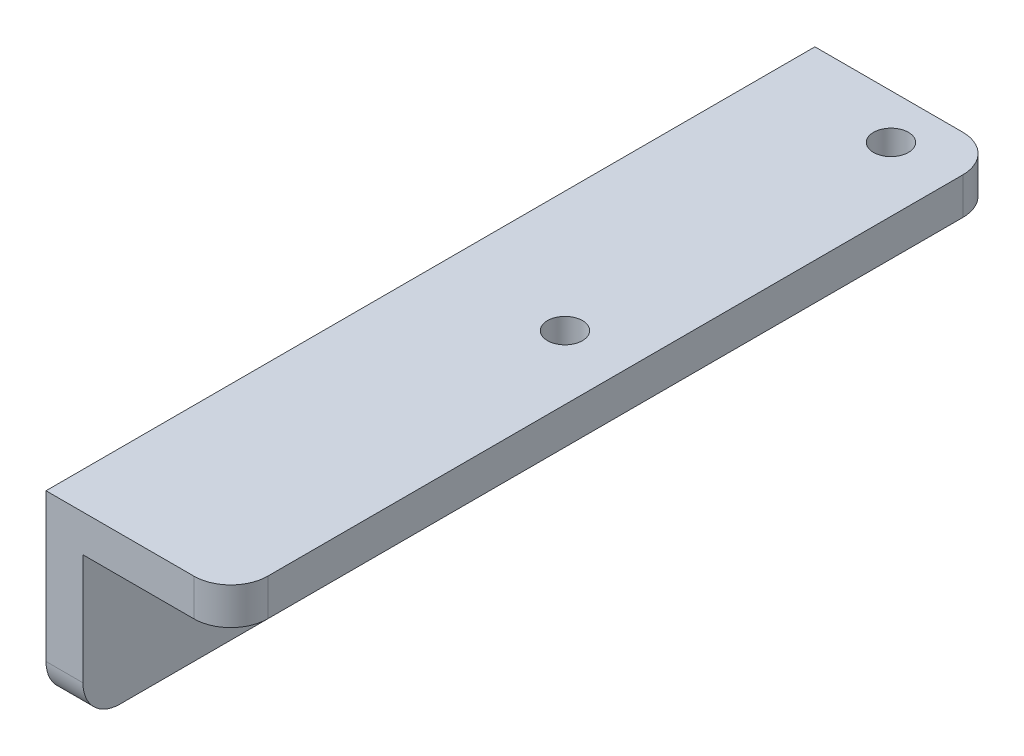
ISO-10303-21;
HEADER;
FILE_DESCRIPTION(('STEP AP214'),'2;1');
FILE_NAME('part.step','',(''),(''),'','','');
FILE_SCHEMA(('AUTOMOTIVE_DESIGN { 1 0 10303 214 1 1 1 1 }'));
ENDSEC;
DATA;
#1=APPLICATION_CONTEXT('core data for automotive mechanical design processes');
#2=APPLICATION_PROTOCOL_DEFINITION('international standard','automotive_design',2000,#1);
#3=PRODUCT_CONTEXT('',#1,'mechanical');
#4=PRODUCT('Part','Part','',(#3));
#5=PRODUCT_RELATED_PRODUCT_CATEGORY('part','',(#4));
#6=PRODUCT_DEFINITION_FORMATION('','',#4);
#7=PRODUCT_DEFINITION_CONTEXT('part definition',#1,'design');
#8=PRODUCT_DEFINITION('design','',#6,#7);
#9=PRODUCT_DEFINITION_SHAPE('','',#8);
#10=(LENGTH_UNIT() NAMED_UNIT(*) SI_UNIT(.MILLI.,.METRE.));
#11=(NAMED_UNIT(*) PLANE_ANGLE_UNIT() SI_UNIT($,.RADIAN.));
#12=(NAMED_UNIT(*) SI_UNIT($,.STERADIAN.) SOLID_ANGLE_UNIT());
#13=UNCERTAINTY_MEASURE_WITH_UNIT(LENGTH_MEASURE(1.E-05),#10,'distance_accuracy_value','');
#14=(GEOMETRIC_REPRESENTATION_CONTEXT(3) GLOBAL_UNCERTAINTY_ASSIGNED_CONTEXT((#13)) GLOBAL_UNIT_ASSIGNED_CONTEXT((#10,
#11,#12)) REPRESENTATION_CONTEXT('',''));
#15=CARTESIAN_POINT('',(0.,0.,0.));
#16=DIRECTION('',(0.,0.,1.));
#17=DIRECTION('',(1.,0.,0.));
#18=AXIS2_PLACEMENT_3D('',#15,#16,#17);
#19=CARTESIAN_POINT('',(0.,-15.875,-66.04));
#20=DIRECTION('',(0.,-1.,0.));
#21=DIRECTION('',(0.,0.,-1.));
#22=AXIS2_PLACEMENT_3D('',#19,#20,#21);
#23=PLANE('',#22);
#24=DIRECTION('',(0.,0.,1.));
#25=VECTOR('',#24,1.);
#26=CARTESIAN_POINT('',(3.175,-15.875,-66.04));
#27=LINE('',#26,#25);
#28=CARTESIAN_POINT('',(3.175,-15.875,-17.145));
#29=VERTEX_POINT('',#28);
#30=CARTESIAN_POINT('',(3.175,-15.875,-3.175));
#31=VERTEX_POINT('',#30);
#32=EDGE_CURVE('E251',#29,#31,#27,.T.);
#33=ORIENTED_EDGE('',*,*,#32,.T.);
#34=DIRECTION('',(1.,0.,0.));
#35=VECTOR('',#34,1.);
#36=CARTESIAN_POINT('',(0.,-15.875,-3.175));
#37=LINE('',#36,#35);
#38=CARTESIAN_POINT('',(0.,-15.875,-3.175));
#39=VERTEX_POINT('',#38);
#40=EDGE_CURVE('E287',#31,#39,#37,.F.);
#41=ORIENTED_EDGE('',*,*,#40,.T.);
#42=DIRECTION('',(0.,0.,1.));
#43=VECTOR('',#42,1.);
#44=CARTESIAN_POINT('',(0.,-15.875,-66.04));
#45=LINE('',#44,#43);
#46=CARTESIAN_POINT('',(0.,-15.875,-37.465));
#47=VERTEX_POINT('',#46);
#48=EDGE_CURVE('E252',#47,#39,#45,.T.);
#49=ORIENTED_EDGE('',*,*,#48,.F.);
#50=DIRECTION('',(-1.,0.,0.));
#51=VECTOR('',#50,1.);
#52=CARTESIAN_POINT('',(0.,-15.875,-37.465));
#53=LINE('',#52,#51);
#54=CARTESIAN_POINT('',(3.175,-15.875,-37.465));
#55=VERTEX_POINT('',#54);
#56=EDGE_CURVE('E285',#47,#55,#53,.F.);
#57=ORIENTED_EDGE('',*,*,#56,.T.);
#58=CARTESIAN_POINT('',(3.175,-15.875,-22.225));
#59=VERTEX_POINT('',#58);
#60=EDGE_CURVE('E249',#55,#59,#27,.T.);
#61=ORIENTED_EDGE('',*,*,#60,.T.);
#62=DIRECTION('',(0.,0.,-1.));
#63=VECTOR('',#62,1.);
#64=CARTESIAN_POINT('',(3.175,-15.875,-17.145));
#65=LINE('',#64,#63);
#66=EDGE_CURVE('E198',#29,#59,#65,.T.);
#67=ORIENTED_EDGE('',*,*,#66,.F.);
#68=EDGE_LOOP('',(#33,#41,#49,#57,#61,#67));
#69=FACE_BOUND('',#68,.T.);
#70=ADVANCED_FACE('F45',(#69),#23,.T.);
#71=CARTESIAN_POINT('',(0.,-3.175,-66.04));
#72=DIRECTION('',(0.,-1.,0.));
#73=DIRECTION('',(0.,0.,-1.));
#74=AXIS2_PLACEMENT_3D('',#71,#72,#73);
#75=PLANE('',#74);
#76=DIRECTION('',(0.,0.,1.));
#77=VECTOR('',#76,1.);
#78=CARTESIAN_POINT('',(15.875,-3.175,-66.04));
#79=LINE('',#78,#77);
#80=CARTESIAN_POINT('',(15.875,-3.175,-17.145));
#81=VERTEX_POINT('',#80);
#82=CARTESIAN_POINT('',(15.875,-3.175,-3.175));
#83=VERTEX_POINT('',#82);
#84=EDGE_CURVE('E234',#81,#83,#79,.T.);
#85=ORIENTED_EDGE('',*,*,#84,.T.);
#86=CARTESIAN_POINT('',(12.7,-3.175,-3.175));
#87=DIRECTION('',(0.,-1.,0.));
#88=DIRECTION('',(0.,0.,-1.));
#89=AXIS2_PLACEMENT_3D('',#86,#87,#88);
#90=CIRCLE('',#89,3.175);
#91=CARTESIAN_POINT('',(12.7,-3.175,0.));
#92=VERTEX_POINT('',#91);
#93=EDGE_CURVE('E281',#83,#92,#90,.T.);
#94=ORIENTED_EDGE('',*,*,#93,.T.);
#95=DIRECTION('',(1.,0.,0.));
#96=VECTOR('',#95,1.);
#97=CARTESIAN_POINT('',(0.,-3.175,0.));
#98=LINE('',#97,#96);
#99=CARTESIAN_POINT('',(3.175,-3.175,0.));
#100=VERTEX_POINT('',#99);
#101=EDGE_CURVE('E214',#100,#92,#98,.T.);
#102=ORIENTED_EDGE('',*,*,#101,.F.);
#103=DIRECTION('',(0.,0.,1.));
#104=VECTOR('',#103,1.);
#105=CARTESIAN_POINT('',(3.175,-3.175,-66.04));
#106=LINE('',#105,#104);
#107=CARTESIAN_POINT('',(3.175,-3.175,-17.145));
#108=VERTEX_POINT('',#107);
#109=EDGE_CURVE('E248',#108,#100,#106,.T.);
#110=ORIENTED_EDGE('',*,*,#109,.F.);
#111=DIRECTION('',(-1.,0.,0.));
#112=VECTOR('',#111,1.);
#113=CARTESIAN_POINT('',(3.175,-3.175,-17.145));
#114=LINE('',#113,#112);
#115=EDGE_CURVE('E191',#81,#108,#114,.T.);
#116=ORIENTED_EDGE('',*,*,#115,.F.);
#117=EDGE_LOOP('',(#85,#94,#102,#110,#116));
#118=FACE_BOUND('',#117,.T.);
#119=ADVANCED_FACE('F322',(#118),#75,.T.);
#120=CARTESIAN_POINT('',(3.175,0.,-66.04));
#121=DIRECTION('',(1.,0.,0.));
#122=DIRECTION('',(0.,0.,-1.));
#123=AXIS2_PLACEMENT_3D('',#120,#121,#122);
#124=PLANE('',#123);
#125=CARTESIAN_POINT('',(3.175,-9.525,-9.94999999999847));
#126=DIRECTION('',(1.,0.,0.));
#127=DIRECTION('',(0.,0.,-1.));
#128=AXIS2_PLACEMENT_3D('',#125,#126,#127);
#129=CIRCLE('',#128,2.49999999987849);
#130=CARTESIAN_POINT('',(3.175,-9.525,-12.449999999877));
#131=VERTEX_POINT('',#130);
#132=EDGE_CURVE('E218',#131,#131,#129,.T.);
#133=ORIENTED_EDGE('',*,*,#132,.F.);
#134=EDGE_LOOP('',(#133));
#135=FACE_BOUND('',#134,.T.);
#136=DIRECTION('',(0.,1.,0.));
#137=VECTOR('',#136,1.);
#138=CARTESIAN_POINT('',(3.175,0.,0.));
#139=LINE('',#138,#137);
#140=CARTESIAN_POINT('',(3.175,-12.7,0.));
#141=VERTEX_POINT('',#140);
#142=EDGE_CURVE('E227',#141,#100,#139,.T.);
#143=ORIENTED_EDGE('',*,*,#142,.F.);
#144=CARTESIAN_POINT('',(3.175,-12.7,-3.175));
#145=DIRECTION('',(1.,0.,0.));
#146=DIRECTION('',(0.,0.,-1.));
#147=AXIS2_PLACEMENT_3D('',#144,#145,#146);
#148=CIRCLE('',#147,3.175);
#149=EDGE_CURVE('E283',#141,#31,#148,.T.);
#150=ORIENTED_EDGE('',*,*,#149,.T.);
#151=ORIENTED_EDGE('',*,*,#32,.F.);
#152=DIRECTION('',(0.,-1.,0.));
#153=VECTOR('',#152,1.);
#154=CARTESIAN_POINT('',(3.175,-15.875,-17.145));
#155=LINE('',#154,#153);
#156=EDGE_CURVE('E195',#108,#29,#155,.T.);
#157=ORIENTED_EDGE('',*,*,#156,.F.);
#158=ORIENTED_EDGE('',*,*,#109,.T.);
#159=EDGE_LOOP('',(#143,#150,#151,#157,#158));
#160=FACE_BOUND('',#159,.T.);
#161=ADVANCED_FACE('F329',(#135,#160),#124,.T.);
#162=CARTESIAN_POINT('',(10.375,-3.175,-34.1966885776124));
#163=DIRECTION('',(0.,-1.,0.));
#164=DIRECTION('',(0.,0.,-1.));
#165=AXIS2_PLACEMENT_3D('',#162,#163,#164);
#166=CIRCLE('',#165,1.5);
#167=CARTESIAN_POINT('',(10.375,-3.175,-35.6966885776124));
#168=VERTEX_POINT('',#167);
#169=EDGE_CURVE('E264',#168,#168,#166,.T.);
#170=ORIENTED_EDGE('',*,*,#169,.F.);
#171=EDGE_LOOP('',(#170));
#172=FACE_BOUND('',#171,.T.);
#173=CARTESIAN_POINT('',(10.375,-3.175,-62.1966885776124));
#174=DIRECTION('',(0.,-1.,0.));
#175=DIRECTION('',(0.,0.,-1.));
#176=AXIS2_PLACEMENT_3D('',#173,#174,#175);
#177=CIRCLE('',#176,1.5);
#178=CARTESIAN_POINT('',(10.375,-3.175,-63.6966885776124));
#179=VERTEX_POINT('',#178);
#180=EDGE_CURVE('E574',#179,#179,#177,.T.);
#181=ORIENTED_EDGE('',*,*,#180,.F.);
#182=EDGE_LOOP('',(#181));
#183=FACE_BOUND('',#182,.T.);
#184=DIRECTION('',(1.,0.,0.));
#185=VECTOR('',#184,1.);
#186=CARTESIAN_POINT('',(0.,-3.175,-66.04));
#187=LINE('',#186,#185);
#188=CARTESIAN_POINT('',(3.175,-3.175,-66.04));
#189=VERTEX_POINT('',#188);
#190=CARTESIAN_POINT('',(12.7,-3.175,-66.04));
#191=VERTEX_POINT('',#190);
#192=EDGE_CURVE('E223',#189,#191,#187,.T.);
#193=ORIENTED_EDGE('',*,*,#192,.T.);
#194=CARTESIAN_POINT('',(12.7,-3.175,-62.865));
#195=DIRECTION('',(0.,-1.,0.));
#196=DIRECTION('',(0.,0.,-1.));
#197=AXIS2_PLACEMENT_3D('',#194,#195,#196);
#198=CIRCLE('',#197,3.175);
#199=CARTESIAN_POINT('',(15.875,-3.175,-62.865));
#200=VERTEX_POINT('',#199);
#201=EDGE_CURVE('E298',#191,#200,#198,.T.);
#202=ORIENTED_EDGE('',*,*,#201,.T.);
#203=CARTESIAN_POINT('',(15.875,-3.175,-22.225));
#204=VERTEX_POINT('',#203);
#205=EDGE_CURVE('E259',#200,#204,#79,.T.);
#206=ORIENTED_EDGE('',*,*,#205,.T.);
#207=DIRECTION('',(-1.,0.,0.));
#208=VECTOR('',#207,1.);
#209=CARTESIAN_POINT('',(3.175,-3.175,-22.225));
#210=LINE('',#209,#208);
#211=CARTESIAN_POINT('',(3.175,-3.175,-22.225));
#212=VERTEX_POINT('',#211);
#213=EDGE_CURVE('E201',#204,#212,#210,.T.);
#214=ORIENTED_EDGE('',*,*,#213,.T.);
#215=EDGE_CURVE('E244',#189,#212,#106,.T.);
#216=ORIENTED_EDGE('',*,*,#215,.F.);
#217=EDGE_LOOP('',(#193,#202,#206,#214,#216));
#218=FACE_BOUND('',#217,.T.);
#219=ADVANCED_FACE('F332',(#172,#183,#218),#75,.T.);
#220=DIRECTION('',(0.,0.,-1.));
#221=VECTOR('',#220,1.);
#222=CARTESIAN_POINT('',(3.175,-8.255,-40.64));
#223=LINE('',#222,#221);
#224=CARTESIAN_POINT('',(3.175,-8.255,-40.64));
#225=VERTEX_POINT('',#224);
#226=CARTESIAN_POINT('',(3.175,-8.255,-62.865));
#227=VERTEX_POINT('',#226);
#228=EDGE_CURVE('E174',#225,#227,#223,.T.);
#229=ORIENTED_EDGE('',*,*,#228,.T.);
#230=CARTESIAN_POINT('',(3.175,-5.08,-62.865));
#231=DIRECTION('',(1.,0.,0.));
#232=DIRECTION('',(0.,0.,-1.));
#233=AXIS2_PLACEMENT_3D('',#230,#231,#232);
#234=CIRCLE('',#233,3.175);
#235=CARTESIAN_POINT('',(3.175,-5.08,-66.04));
#236=VERTEX_POINT('',#235);
#237=EDGE_CURVE('E53',#227,#236,#234,.T.);
#238=ORIENTED_EDGE('',*,*,#237,.T.);
#239=DIRECTION('',(0.,1.,0.));
#240=VECTOR('',#239,1.);
#241=CARTESIAN_POINT('',(3.175,0.,-66.04));
#242=LINE('',#241,#240);
#243=EDGE_CURVE('E232',#236,#189,#242,.T.);
#244=ORIENTED_EDGE('',*,*,#243,.T.);
#245=ORIENTED_EDGE('',*,*,#215,.T.);
#246=DIRECTION('',(0.,-1.,0.));
#247=VECTOR('',#246,1.);
#248=CARTESIAN_POINT('',(3.175,-15.875,-22.225));
#249=LINE('',#248,#247);
#250=EDGE_CURVE('E192',#212,#59,#249,.T.);
#251=ORIENTED_EDGE('',*,*,#250,.T.);
#252=ORIENTED_EDGE('',*,*,#60,.F.);
#253=CARTESIAN_POINT('',(3.175,-12.7,-37.465));
#254=DIRECTION('',(1.,0.,0.));
#255=DIRECTION('',(0.,0.,-1.));
#256=AXIS2_PLACEMENT_3D('',#253,#254,#255);
#257=CIRCLE('',#256,3.175);
#258=CARTESIAN_POINT('',(3.175,-12.7,-40.64));
#259=VERTEX_POINT('',#258);
#260=EDGE_CURVE('E60',#55,#259,#257,.T.);
#261=ORIENTED_EDGE('',*,*,#260,.T.);
#262=DIRECTION('',(0.,-1.,0.));
#263=VECTOR('',#262,1.);
#264=CARTESIAN_POINT('',(3.175,-15.875,-40.64));
#265=LINE('',#264,#263);
#266=EDGE_CURVE('E175',#225,#259,#265,.T.);
#267=ORIENTED_EDGE('',*,*,#266,.F.);
#268=EDGE_LOOP('',(#229,#238,#244,#245,#251,#252,#261,#267));
#269=FACE_BOUND('',#268,.T.);
#270=CARTESIAN_POINT('',(3.175,-9.52499999999992,-29.9499999999985));
#271=DIRECTION('',(1.,0.,0.));
#272=DIRECTION('',(0.,0.,-1.));
#273=AXIS2_PLACEMENT_3D('',#270,#271,#272);
#274=CIRCLE('',#273,2.49999999987849);
#275=CARTESIAN_POINT('',(3.175,-9.52499999999992,-32.449999999877));
#276=VERTEX_POINT('',#275);
#277=EDGE_CURVE('E215',#276,#276,#274,.T.);
#278=ORIENTED_EDGE('',*,*,#277,.F.);
#279=EDGE_LOOP('',(#278));
#280=FACE_BOUND('',#279,.T.);
#281=ADVANCED_FACE('F303',(#269,#280),#124,.T.);
#282=CARTESIAN_POINT('',(0.,0.,-66.04));
#283=DIRECTION('',(-1.,0.,0.));
#284=DIRECTION('',(0.,-1.,0.));
#285=AXIS2_PLACEMENT_3D('',#282,#283,#284);
#286=PLANE('',#285);
#287=ORIENTED_EDGE('',*,*,#48,.T.);
#288=CARTESIAN_POINT('',(0.,-12.7,-3.175));
#289=DIRECTION('',(-1.,0.,0.));
#290=DIRECTION('',(0.,-1.,0.));
#291=AXIS2_PLACEMENT_3D('',#288,#289,#290);
#292=CIRCLE('',#291,3.175);
#293=CARTESIAN_POINT('',(0.,-12.7,0.));
#294=VERTEX_POINT('',#293);
#295=EDGE_CURVE('E292',#39,#294,#292,.T.);
#296=ORIENTED_EDGE('',*,*,#295,.T.);
#297=DIRECTION('',(0.,-1.,0.));
#298=VECTOR('',#297,1.);
#299=CARTESIAN_POINT('',(0.,0.,0.));
#300=LINE('',#299,#298);
#301=CARTESIAN_POINT('',(0.,0.,0.));
#302=VERTEX_POINT('',#301);
#303=EDGE_CURVE('E240',#302,#294,#300,.T.);
#304=ORIENTED_EDGE('',*,*,#303,.F.);
#305=DIRECTION('',(0.,0.,1.));
#306=VECTOR('',#305,1.);
#307=CARTESIAN_POINT('',(0.,0.,-66.04));
#308=LINE('',#307,#306);
#309=CARTESIAN_POINT('',(0.,0.,-66.04));
#310=VERTEX_POINT('',#309);
#311=EDGE_CURVE('E254',#310,#302,#308,.T.);
#312=ORIENTED_EDGE('',*,*,#311,.F.);
#313=DIRECTION('',(0.,-1.,0.));
#314=VECTOR('',#313,1.);
#315=CARTESIAN_POINT('',(0.,0.,-66.04));
#316=LINE('',#315,#314);
#317=CARTESIAN_POINT('',(0.,-5.08,-66.04));
#318=VERTEX_POINT('',#317);
#319=EDGE_CURVE('E230',#310,#318,#316,.T.);
#320=ORIENTED_EDGE('',*,*,#319,.T.);
#321=CARTESIAN_POINT('',(0.,-5.08,-62.865));
#322=DIRECTION('',(-1.,0.,0.));
#323=DIRECTION('',(0.,-1.,0.));
#324=AXIS2_PLACEMENT_3D('',#321,#322,#323);
#325=CIRCLE('',#324,3.175);
#326=CARTESIAN_POINT('',(0.,-8.255,-62.865));
#327=VERTEX_POINT('',#326);
#328=EDGE_CURVE('E182',#318,#327,#325,.T.);
#329=ORIENTED_EDGE('',*,*,#328,.T.);
#330=DIRECTION('',(0.,0.,-1.));
#331=VECTOR('',#330,1.);
#332=CARTESIAN_POINT('',(0.,-8.255,-40.64));
#333=LINE('',#332,#331);
#334=CARTESIAN_POINT('',(0.,-8.255,-40.64));
#335=VERTEX_POINT('',#334);
#336=EDGE_CURVE('E172',#335,#327,#333,.T.);
#337=ORIENTED_EDGE('',*,*,#336,.F.);
#338=DIRECTION('',(0.,1.,0.));
#339=VECTOR('',#338,1.);
#340=CARTESIAN_POINT('',(0.,-15.875,-40.64));
#341=LINE('',#340,#339);
#342=CARTESIAN_POINT('',(0.,-12.7,-40.64));
#343=VERTEX_POINT('',#342);
#344=EDGE_CURVE('E160',#343,#335,#341,.T.);
#345=ORIENTED_EDGE('',*,*,#344,.F.);
#346=CARTESIAN_POINT('',(0.,-12.7,-37.465));
#347=DIRECTION('',(-1.,0.,0.));
#348=DIRECTION('',(0.,-1.,0.));
#349=AXIS2_PLACEMENT_3D('',#346,#347,#348);
#350=CIRCLE('',#349,3.175);
#351=EDGE_CURVE('E289',#343,#47,#350,.T.);
#352=ORIENTED_EDGE('',*,*,#351,.T.);
#353=EDGE_LOOP('',(#287,#296,#304,#312,#320,#329,#337,#345,#352));
#354=FACE_BOUND('',#353,.T.);
#355=CARTESIAN_POINT('',(0.,-9.52499999999992,-29.9499999999985));
#356=DIRECTION('',(1.,0.,0.));
#357=DIRECTION('',(0.,0.,-1.));
#358=AXIS2_PLACEMENT_3D('',#355,#356,#357);
#359=CIRCLE('',#358,2.49999999987849);
#360=CARTESIAN_POINT('',(0.,-9.52499999999992,-32.449999999877));
#361=VERTEX_POINT('',#360);
#362=EDGE_CURVE('E211',#361,#361,#359,.T.);
#363=ORIENTED_EDGE('',*,*,#362,.T.);
#364=EDGE_LOOP('',(#363));
#365=FACE_BOUND('',#364,.T.);
#366=CARTESIAN_POINT('',(0.,-9.525,-9.94999999999847));
#367=DIRECTION('',(1.,0.,0.));
#368=DIRECTION('',(0.,0.,-1.));
#369=AXIS2_PLACEMENT_3D('',#366,#367,#368);
#370=CIRCLE('',#369,2.49999999987849);
#371=CARTESIAN_POINT('',(0.,-9.525,-12.449999999877));
#372=VERTEX_POINT('',#371);
#373=EDGE_CURVE('E210',#372,#372,#370,.T.);
#374=ORIENTED_EDGE('',*,*,#373,.T.);
#375=EDGE_LOOP('',(#374));
#376=FACE_BOUND('',#375,.T.);
#377=ADVANCED_FACE('F178',(#354,#365,#376),#286,.T.);
#378=CARTESIAN_POINT('',(0.,0.,-66.04));
#379=DIRECTION('',(0.,-1.,0.));
#380=DIRECTION('',(0.,0.,-1.));
#381=AXIS2_PLACEMENT_3D('',#378,#379,#380);
#382=PLANE('',#381);
#383=CARTESIAN_POINT('',(10.375,0.,-34.1966885776124));
#384=DIRECTION('',(0.,-1.,0.));
#385=DIRECTION('',(0.,0.,-1.));
#386=AXIS2_PLACEMENT_3D('',#383,#384,#385);
#387=CIRCLE('',#386,1.5);
#388=CARTESIAN_POINT('',(10.375,0.,-35.6966885776124));
#389=VERTEX_POINT('',#388);
#390=EDGE_CURVE('E167',#389,#389,#387,.T.);
#391=ORIENTED_EDGE('',*,*,#390,.T.);
#392=EDGE_LOOP('',(#391));
#393=FACE_BOUND('',#392,.T.);
#394=CARTESIAN_POINT('',(10.375,0.,-62.1966885776124));
#395=DIRECTION('',(0.,-1.,0.));
#396=DIRECTION('',(0.,0.,-1.));
#397=AXIS2_PLACEMENT_3D('',#394,#395,#396);
#398=CIRCLE('',#397,1.5);
#399=CARTESIAN_POINT('',(10.375,0.,-63.6966885776124));
#400=VERTEX_POINT('',#399);
#401=EDGE_CURVE('E261',#400,#400,#398,.T.);
#402=ORIENTED_EDGE('',*,*,#401,.T.);
#403=EDGE_LOOP('',(#402));
#404=FACE_BOUND('',#403,.T.);
#405=DIRECTION('',(1.,0.,0.));
#406=VECTOR('',#405,1.);
#407=CARTESIAN_POINT('',(0.,0.,0.));
#408=LINE('',#407,#406);
#409=CARTESIAN_POINT('',(12.7,0.,0.));
#410=VERTEX_POINT('',#409);
#411=EDGE_CURVE('E237',#302,#410,#408,.T.);
#412=ORIENTED_EDGE('',*,*,#411,.T.);
#413=CARTESIAN_POINT('',(12.7,0.,-3.175));
#414=DIRECTION('',(0.,-1.,0.));
#415=DIRECTION('',(0.,0.,-1.));
#416=AXIS2_PLACEMENT_3D('',#413,#414,#415);
#417=CIRCLE('',#416,3.175);
#418=CARTESIAN_POINT('',(15.875,0.,-3.175));
#419=VERTEX_POINT('',#418);
#420=EDGE_CURVE('E274',#410,#419,#417,.F.);
#421=ORIENTED_EDGE('',*,*,#420,.T.);
#422=DIRECTION('',(0.,0.,1.));
#423=VECTOR('',#422,1.);
#424=CARTESIAN_POINT('',(15.875,0.,-66.04));
#425=LINE('',#424,#423);
#426=CARTESIAN_POINT('',(15.875,0.,-62.865));
#427=VERTEX_POINT('',#426);
#428=EDGE_CURVE('E256',#427,#419,#425,.T.);
#429=ORIENTED_EDGE('',*,*,#428,.F.);
#430=CARTESIAN_POINT('',(12.7,0.,-62.865));
#431=DIRECTION('',(0.,-1.,0.));
#432=DIRECTION('',(0.,0.,-1.));
#433=AXIS2_PLACEMENT_3D('',#430,#431,#432);
#434=CIRCLE('',#433,3.175);
#435=CARTESIAN_POINT('',(12.7,0.,-66.04));
#436=VERTEX_POINT('',#435);
#437=EDGE_CURVE('E272',#427,#436,#434,.F.);
#438=ORIENTED_EDGE('',*,*,#437,.T.);
#439=DIRECTION('',(1.,0.,0.));
#440=VECTOR('',#439,1.);
#441=CARTESIAN_POINT('',(0.,0.,-66.04));
#442=LINE('',#441,#440);
#443=EDGE_CURVE('E226',#310,#436,#442,.T.);
#444=ORIENTED_EDGE('',*,*,#443,.F.);
#445=ORIENTED_EDGE('',*,*,#311,.T.);
#446=EDGE_LOOP('',(#412,#421,#429,#438,#444,#445));
#447=FACE_BOUND('',#446,.T.);
#448=ADVANCED_FACE('F339',(#393,#404,#447),#382,.F.);
#449=CARTESIAN_POINT('',(15.875,0.,-66.04));
#450=DIRECTION('',(1.,0.,0.));
#451=DIRECTION('',(0.,0.,-1.));
#452=AXIS2_PLACEMENT_3D('',#449,#450,#451);
#453=PLANE('',#452);
#454=ORIENTED_EDGE('',*,*,#428,.T.);
#455=DIRECTION('',(0.,1.,0.));
#456=VECTOR('',#455,1.);
#457=CARTESIAN_POINT('',(15.875,0.,-3.175));
#458=LINE('',#457,#456);
#459=EDGE_CURVE('E279',#419,#83,#458,.F.);
#460=ORIENTED_EDGE('',*,*,#459,.T.);
#461=ORIENTED_EDGE('',*,*,#84,.F.);
#462=DIRECTION('',(0.,0.,-1.));
#463=VECTOR('',#462,1.);
#464=CARTESIAN_POINT('',(15.875,-3.175,-17.145));
#465=LINE('',#464,#463);
#466=EDGE_CURVE('E207',#81,#204,#465,.T.);
#467=ORIENTED_EDGE('',*,*,#466,.T.);
#468=ORIENTED_EDGE('',*,*,#205,.F.);
#469=DIRECTION('',(0.,1.,0.));
#470=VECTOR('',#469,1.);
#471=CARTESIAN_POINT('',(15.875,0.,-62.865));
#472=LINE('',#471,#470);
#473=EDGE_CURVE('E276',#200,#427,#472,.T.);
#474=ORIENTED_EDGE('',*,*,#473,.T.);
#475=EDGE_LOOP('',(#454,#460,#461,#467,#468,#474));
#476=FACE_BOUND('',#475,.T.);
#477=ADVANCED_FACE('F342',(#476),#453,.T.);
#478=CARTESIAN_POINT('',(0.,0.,-66.04));
#479=DIRECTION('',(0.,0.,1.));
#480=DIRECTION('',(1.,0.,0.));
#481=AXIS2_PLACEMENT_3D('',#478,#479,#480);
#482=PLANE('',#481);
#483=ORIENTED_EDGE('',*,*,#443,.T.);
#484=DIRECTION('',(0.,1.,0.));
#485=VECTOR('',#484,1.);
#486=CARTESIAN_POINT('',(12.7,-3.175,-66.04));
#487=LINE('',#486,#485);
#488=EDGE_CURVE('E296',#436,#191,#487,.F.);
#489=ORIENTED_EDGE('',*,*,#488,.T.);
#490=ORIENTED_EDGE('',*,*,#192,.F.);
#491=ORIENTED_EDGE('',*,*,#243,.F.);
#492=DIRECTION('',(1.,0.,0.));
#493=VECTOR('',#492,1.);
#494=CARTESIAN_POINT('',(0.,-5.08,-66.04));
#495=LINE('',#494,#493);
#496=EDGE_CURVE('E294',#236,#318,#495,.F.);
#497=ORIENTED_EDGE('',*,*,#496,.T.);
#498=ORIENTED_EDGE('',*,*,#319,.F.);
#499=EDGE_LOOP('',(#483,#489,#490,#491,#497,#498));
#500=FACE_BOUND('',#499,.T.);
#501=ADVANCED_FACE('F308',(#500),#482,.F.);
#502=CARTESIAN_POINT('',(0.,0.,0.));
#503=DIRECTION('',(0.,0.,1.));
#504=DIRECTION('',(1.,0.,0.));
#505=AXIS2_PLACEMENT_3D('',#502,#503,#504);
#506=PLANE('',#505);
#507=ORIENTED_EDGE('',*,*,#101,.T.);
#508=DIRECTION('',(0.,1.,0.));
#509=VECTOR('',#508,1.);
#510=CARTESIAN_POINT('',(12.7,0.,0.));
#511=LINE('',#510,#509);
#512=EDGE_CURVE('E269',#92,#410,#511,.T.);
#513=ORIENTED_EDGE('',*,*,#512,.T.);
#514=ORIENTED_EDGE('',*,*,#411,.F.);
#515=ORIENTED_EDGE('',*,*,#303,.T.);
#516=DIRECTION('',(1.,0.,0.));
#517=VECTOR('',#516,1.);
#518=CARTESIAN_POINT('',(0.,-12.7,0.));
#519=LINE('',#518,#517);
#520=EDGE_CURVE('E247',#294,#141,#519,.T.);
#521=ORIENTED_EDGE('',*,*,#520,.T.);
#522=ORIENTED_EDGE('',*,*,#142,.T.);
#523=EDGE_LOOP('',(#507,#513,#514,#515,#521,#522));
#524=FACE_BOUND('',#523,.T.);
#525=ADVANCED_FACE('F365',(#524),#506,.T.);
#526=CARTESIAN_POINT('',(0.,-9.525,-9.94999999999847));
#527=DIRECTION('',(1.,0.,0.));
#528=DIRECTION('',(0.,0.,-1.));
#529=AXIS2_PLACEMENT_3D('',#526,#527,#528);
#530=CYLINDRICAL_SURFACE('',#529,2.49999999987849);
#531=ORIENTED_EDGE('',*,*,#373,.F.);
#532=EDGE_LOOP('',(#531));
#533=FACE_BOUND('',#532,.T.);
#534=ORIENTED_EDGE('',*,*,#132,.T.);
#535=EDGE_LOOP('',(#534));
#536=FACE_BOUND('',#535,.T.);
#537=ADVANCED_FACE('F435',(#533,#536),#530,.F.);
#538=CARTESIAN_POINT('',(0.,-9.52499999999992,-29.9499999999985));
#539=DIRECTION('',(1.,0.,0.));
#540=DIRECTION('',(0.,0.,-1.));
#541=AXIS2_PLACEMENT_3D('',#538,#539,#540);
#542=CYLINDRICAL_SURFACE('',#541,2.49999999987849);
#543=ORIENTED_EDGE('',*,*,#362,.F.);
#544=EDGE_LOOP('',(#543));
#545=FACE_BOUND('',#544,.T.);
#546=ORIENTED_EDGE('',*,*,#277,.T.);
#547=EDGE_LOOP('',(#546));
#548=FACE_BOUND('',#547,.T.);
#549=ADVANCED_FACE('F516',(#545,#548),#542,.F.);
#550=CARTESIAN_POINT('',(3.175,-15.875,-17.145));
#551=DIRECTION('',(-0.707106781186548,0.707106781186548,0.));
#552=DIRECTION('',(-0.707106781186548,-0.707106781186548,0.));
#553=AXIS2_PLACEMENT_3D('',#550,#551,#552);
#554=PLANE('',#553);
#555=DIRECTION('',(0.707106781186547,0.707106781186547,0.));
#556=VECTOR('',#555,1.);
#557=CARTESIAN_POINT('',(3.175,-15.875,-22.225));
#558=LINE('',#557,#556);
#559=EDGE_CURVE('E184',#59,#204,#558,.T.);
#560=ORIENTED_EDGE('',*,*,#559,.T.);
#561=ORIENTED_EDGE('',*,*,#466,.F.);
#562=DIRECTION('',(0.707106781186547,0.707106781186547,0.));
#563=VECTOR('',#562,1.);
#564=CARTESIAN_POINT('',(3.175,-15.875,-17.145));
#565=LINE('',#564,#563);
#566=EDGE_CURVE('E188',#29,#81,#565,.T.);
#567=ORIENTED_EDGE('',*,*,#566,.F.);
#568=ORIENTED_EDGE('',*,*,#66,.T.);
#569=EDGE_LOOP('',(#560,#561,#567,#568));
#570=FACE_BOUND('',#569,.T.);
#571=ADVANCED_FACE('F386',(#570),#554,.F.);
#572=CARTESIAN_POINT('',(0.,0.,-17.145));
#573=DIRECTION('',(0.,0.,-1.));
#574=DIRECTION('',(-1.,0.,0.));
#575=AXIS2_PLACEMENT_3D('',#572,#573,#574);
#576=PLANE('',#575);
#577=ORIENTED_EDGE('',*,*,#566,.T.);
#578=ORIENTED_EDGE('',*,*,#115,.T.);
#579=ORIENTED_EDGE('',*,*,#156,.T.);
#580=EDGE_LOOP('',(#577,#578,#579));
#581=FACE_BOUND('',#580,.T.);
#582=ADVANCED_FACE('F389',(#581),#576,.F.);
#583=CARTESIAN_POINT('',(0.,0.,-22.225));
#584=DIRECTION('',(0.,0.,-1.));
#585=DIRECTION('',(-1.,0.,0.));
#586=AXIS2_PLACEMENT_3D('',#583,#584,#585);
#587=PLANE('',#586);
#588=ORIENTED_EDGE('',*,*,#559,.F.);
#589=ORIENTED_EDGE('',*,*,#250,.F.);
#590=ORIENTED_EDGE('',*,*,#213,.F.);
#591=EDGE_LOOP('',(#588,#589,#590));
#592=FACE_BOUND('',#591,.T.);
#593=ADVANCED_FACE('F385',(#592),#587,.T.);
#594=CARTESIAN_POINT('',(0.,-8.255,-40.64));
#595=DIRECTION('',(0.,1.,0.));
#596=DIRECTION('',(0.,0.,1.));
#597=AXIS2_PLACEMENT_3D('',#594,#595,#596);
#598=PLANE('',#597);
#599=ORIENTED_EDGE('',*,*,#336,.T.);
#600=DIRECTION('',(1.,0.,0.));
#601=VECTOR('',#600,1.);
#602=CARTESIAN_POINT('',(0.,-8.255,-62.865));
#603=LINE('',#602,#601);
#604=EDGE_CURVE('E300',#327,#227,#603,.T.);
#605=ORIENTED_EDGE('',*,*,#604,.T.);
#606=ORIENTED_EDGE('',*,*,#228,.F.);
#607=DIRECTION('',(1.,0.,0.));
#608=VECTOR('',#607,1.);
#609=CARTESIAN_POINT('',(0.,-8.255,-40.64));
#610=LINE('',#609,#608);
#611=EDGE_CURVE('E163',#335,#225,#610,.T.);
#612=ORIENTED_EDGE('',*,*,#611,.F.);
#613=EDGE_LOOP('',(#599,#605,#606,#612));
#614=FACE_BOUND('',#613,.T.);
#615=ADVANCED_FACE('F171',(#614),#598,.F.);
#616=CARTESIAN_POINT('',(0.,0.,-40.64));
#617=DIRECTION('',(0.,0.,-1.));
#618=DIRECTION('',(-1.,0.,0.));
#619=AXIS2_PLACEMENT_3D('',#616,#617,#618);
#620=PLANE('',#619);
#621=ORIENTED_EDGE('',*,*,#266,.T.);
#622=DIRECTION('',(-1.,0.,0.));
#623=VECTOR('',#622,1.);
#624=CARTESIAN_POINT('',(0.,-12.7,-40.64));
#625=LINE('',#624,#623);
#626=EDGE_CURVE('E11',#259,#343,#625,.T.);
#627=ORIENTED_EDGE('',*,*,#626,.T.);
#628=ORIENTED_EDGE('',*,*,#344,.T.);
#629=ORIENTED_EDGE('',*,*,#611,.T.);
#630=EDGE_LOOP('',(#621,#627,#628,#629));
#631=FACE_BOUND('',#630,.T.);
#632=ADVANCED_FACE('F162',(#631),#620,.T.);
#633=CARTESIAN_POINT('',(10.375,22.225,-62.1966885776124));
#634=DIRECTION('',(0.,-1.,0.));
#635=DIRECTION('',(0.,0.,-1.));
#636=AXIS2_PLACEMENT_3D('',#633,#634,#635);
#637=CYLINDRICAL_SURFACE('',#636,1.5);
#638=ORIENTED_EDGE('',*,*,#180,.T.);
#639=EDGE_LOOP('',(#638));
#640=FACE_BOUND('',#639,.T.);
#641=ORIENTED_EDGE('',*,*,#401,.F.);
#642=EDGE_LOOP('',(#641));
#643=FACE_BOUND('',#642,.T.);
#644=ADVANCED_FACE('F450',(#640,#643),#637,.F.);
#645=CARTESIAN_POINT('',(10.375,22.225,-34.1966885776124));
#646=DIRECTION('',(0.,-1.,0.));
#647=DIRECTION('',(0.,0.,-1.));
#648=AXIS2_PLACEMENT_3D('',#645,#646,#647);
#649=CYLINDRICAL_SURFACE('',#648,1.5);
#650=ORIENTED_EDGE('',*,*,#169,.T.);
#651=EDGE_LOOP('',(#650));
#652=FACE_BOUND('',#651,.T.);
#653=ORIENTED_EDGE('',*,*,#390,.F.);
#654=EDGE_LOOP('',(#653));
#655=FACE_BOUND('',#654,.T.);
#656=ADVANCED_FACE('F352',(#652,#655),#649,.F.);
#657=CARTESIAN_POINT('',(12.7,0.,-3.175));
#658=DIRECTION('',(0.,1.,0.));
#659=DIRECTION('',(0.,0.,1.));
#660=AXIS2_PLACEMENT_3D('',#657,#658,#659);
#661=CYLINDRICAL_SURFACE('',#660,3.175);
#662=ORIENTED_EDGE('',*,*,#93,.F.);
#663=ORIENTED_EDGE('',*,*,#459,.F.);
#664=ORIENTED_EDGE('',*,*,#420,.F.);
#665=ORIENTED_EDGE('',*,*,#512,.F.);
#666=EDGE_LOOP('',(#662,#663,#664,#665));
#667=FACE_BOUND('',#666,.T.);
#668=ADVANCED_FACE('F349',(#667),#661,.T.);
#669=CARTESIAN_POINT('',(0.,-12.7,-3.175));
#670=DIRECTION('',(1.,0.,0.));
#671=DIRECTION('',(0.,0.,-1.));
#672=AXIS2_PLACEMENT_3D('',#669,#670,#671);
#673=CYLINDRICAL_SURFACE('',#672,3.175);
#674=ORIENTED_EDGE('',*,*,#295,.F.);
#675=ORIENTED_EDGE('',*,*,#40,.F.);
#676=ORIENTED_EDGE('',*,*,#149,.F.);
#677=ORIENTED_EDGE('',*,*,#520,.F.);
#678=EDGE_LOOP('',(#674,#675,#676,#677));
#679=FACE_BOUND('',#678,.T.);
#680=ADVANCED_FACE('F318',(#679),#673,.T.);
#681=CARTESIAN_POINT('',(12.7,0.,-62.865));
#682=DIRECTION('',(0.,-1.,0.));
#683=DIRECTION('',(0.,0.,-1.));
#684=AXIS2_PLACEMENT_3D('',#681,#682,#683);
#685=CYLINDRICAL_SURFACE('',#684,3.175);
#686=ORIENTED_EDGE('',*,*,#201,.F.);
#687=ORIENTED_EDGE('',*,*,#488,.F.);
#688=ORIENTED_EDGE('',*,*,#437,.F.);
#689=ORIENTED_EDGE('',*,*,#473,.F.);
#690=EDGE_LOOP('',(#686,#687,#688,#689));
#691=FACE_BOUND('',#690,.T.);
#692=ADVANCED_FACE('F312',(#691),#685,.T.);
#693=CARTESIAN_POINT('',(0.,-5.08,-62.865));
#694=DIRECTION('',(1.,0.,0.));
#695=DIRECTION('',(0.,0.,-1.));
#696=AXIS2_PLACEMENT_3D('',#693,#694,#695);
#697=CYLINDRICAL_SURFACE('',#696,3.175);
#698=ORIENTED_EDGE('',*,*,#328,.F.);
#699=ORIENTED_EDGE('',*,*,#496,.F.);
#700=ORIENTED_EDGE('',*,*,#237,.F.);
#701=ORIENTED_EDGE('',*,*,#604,.F.);
#702=EDGE_LOOP('',(#698,#699,#700,#701));
#703=FACE_BOUND('',#702,.T.);
#704=ADVANCED_FACE('F310',(#703),#697,.T.);
#705=CARTESIAN_POINT('',(0.,-12.7,-37.465));
#706=DIRECTION('',(-1.,0.,0.));
#707=DIRECTION('',(0.,0.,1.));
#708=AXIS2_PLACEMENT_3D('',#705,#706,#707);
#709=CYLINDRICAL_SURFACE('',#708,3.175);
#710=ORIENTED_EDGE('',*,*,#260,.F.);
#711=ORIENTED_EDGE('',*,*,#56,.F.);
#712=ORIENTED_EDGE('',*,*,#351,.F.);
#713=ORIENTED_EDGE('',*,*,#626,.F.);
#714=EDGE_LOOP('',(#710,#711,#712,#713));
#715=FACE_BOUND('',#714,.T.);
#716=ADVANCED_FACE('F47',(#715),#709,.T.);
#717=CLOSED_SHELL('',(#70,#119,#161,#219,#281,#377,#448,#477,#501,#525,#537,#549,#571,#582,#593,
#615,#632,#644,#656,#668,#680,#692,#704,#716));
#718=MANIFOLD_SOLID_BREP('B2',#717);
#719=ADVANCED_BREP_SHAPE_REPRESENTATION('',(#18,#718),#14);
#720=SHAPE_DEFINITION_REPRESENTATION(#9,#719);
ENDSEC;
END-ISO-10303-21;
